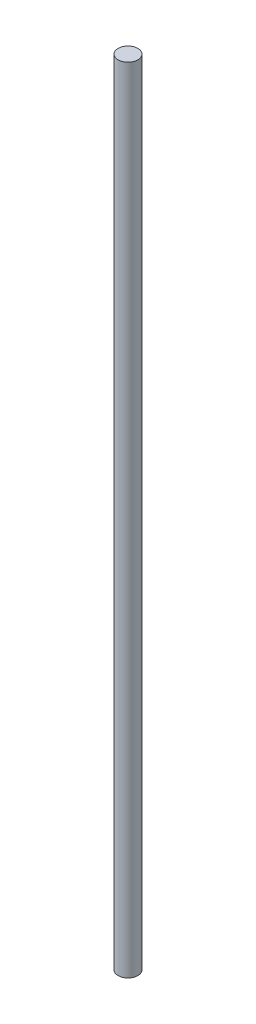
ISO-10303-21;
HEADER;
FILE_DESCRIPTION(('STEP AP214'),'2;1');
FILE_NAME('part.step','',(''),(''),'','','');
FILE_SCHEMA(('AUTOMOTIVE_DESIGN { 1 0 10303 214 1 1 1 1 }'));
ENDSEC;
DATA;
#1=APPLICATION_CONTEXT('core data for automotive mechanical design processes');
#2=APPLICATION_PROTOCOL_DEFINITION('international standard','automotive_design',2000,#1);
#3=PRODUCT_CONTEXT('',#1,'mechanical');
#4=PRODUCT('Part','Part','',(#3));
#5=PRODUCT_RELATED_PRODUCT_CATEGORY('part','',(#4));
#6=PRODUCT_DEFINITION_FORMATION('','',#4);
#7=PRODUCT_DEFINITION_CONTEXT('part definition',#1,'design');
#8=PRODUCT_DEFINITION('design','',#6,#7);
#9=PRODUCT_DEFINITION_SHAPE('','',#8);
#10=(LENGTH_UNIT() NAMED_UNIT(*) SI_UNIT(.MILLI.,.METRE.));
#11=(NAMED_UNIT(*) PLANE_ANGLE_UNIT() SI_UNIT($,.RADIAN.));
#12=(NAMED_UNIT(*) SI_UNIT($,.STERADIAN.) SOLID_ANGLE_UNIT());
#13=UNCERTAINTY_MEASURE_WITH_UNIT(LENGTH_MEASURE(1.E-05),#10,'distance_accuracy_value','');
#14=(GEOMETRIC_REPRESENTATION_CONTEXT(3) GLOBAL_UNCERTAINTY_ASSIGNED_CONTEXT((#13)) GLOBAL_UNIT_ASSIGNED_CONTEXT((#10,
#11,#12)) REPRESENTATION_CONTEXT('',''));
#15=CARTESIAN_POINT('',(0.,0.,0.));
#16=DIRECTION('',(0.,0.,1.));
#17=DIRECTION('',(1.,0.,0.));
#18=AXIS2_PLACEMENT_3D('',#15,#16,#17);
#19=CARTESIAN_POINT('',(0.,400.,0.));
#20=DIRECTION('',(0.,-1.,0.));
#21=DIRECTION('',(0.,0.,-1.));
#22=AXIS2_PLACEMENT_3D('',#19,#20,#21);
#23=CYLINDRICAL_SURFACE('',#22,5.);
#24=CARTESIAN_POINT('',(0.,400.,0.));
#25=DIRECTION('',(0.,1.,0.));
#26=DIRECTION('',(0.,0.,1.));
#27=AXIS2_PLACEMENT_3D('',#24,#25,#26);
#28=CIRCLE('',#27,5.);
#29=CARTESIAN_POINT('',(0.,400.,5.));
#30=VERTEX_POINT('',#29);
#31=EDGE_CURVE('E10',#30,#30,#28,.T.);
#32=ORIENTED_EDGE('',*,*,#31,.F.);
#33=EDGE_LOOP('',(#32));
#34=FACE_BOUND('',#33,.T.);
#35=CARTESIAN_POINT('',(0.,0.,0.));
#36=DIRECTION('',(0.,1.,0.));
#37=DIRECTION('',(0.,0.,1.));
#38=AXIS2_PLACEMENT_3D('',#35,#36,#37);
#39=CIRCLE('',#38,5.);
#40=CARTESIAN_POINT('',(0.,0.,5.));
#41=VERTEX_POINT('',#40);
#42=EDGE_CURVE('E40',#41,#41,#39,.T.);
#43=ORIENTED_EDGE('',*,*,#42,.T.);
#44=EDGE_LOOP('',(#43));
#45=FACE_BOUND('',#44,.T.);
#46=ADVANCED_FACE('F37',(#34,#45),#23,.T.);
#47=CARTESIAN_POINT('',(0.,400.,0.));
#48=DIRECTION('',(0.,1.,0.));
#49=DIRECTION('',(0.,0.,1.));
#50=AXIS2_PLACEMENT_3D('',#47,#48,#49);
#51=PLANE('',#50);
#52=ORIENTED_EDGE('',*,*,#31,.T.);
#53=EDGE_LOOP('',(#52));
#54=FACE_BOUND('',#53,.T.);
#55=ADVANCED_FACE('F54',(#54),#51,.T.);
#56=CARTESIAN_POINT('',(0.,0.,0.));
#57=DIRECTION('',(0.,1.,0.));
#58=DIRECTION('',(0.,0.,1.));
#59=AXIS2_PLACEMENT_3D('',#56,#57,#58);
#60=PLANE('',#59);
#61=ORIENTED_EDGE('',*,*,#42,.F.);
#62=EDGE_LOOP('',(#61));
#63=FACE_BOUND('',#62,.T.);
#64=ADVANCED_FACE('F52',(#63),#60,.F.);
#65=CLOSED_SHELL('',(#46,#55,#64));
#66=MANIFOLD_SOLID_BREP('B2',#65);
#67=ADVANCED_BREP_SHAPE_REPRESENTATION('',(#18,#66),#14);
#68=SHAPE_DEFINITION_REPRESENTATION(#9,#67);
ENDSEC;
END-ISO-10303-21;
